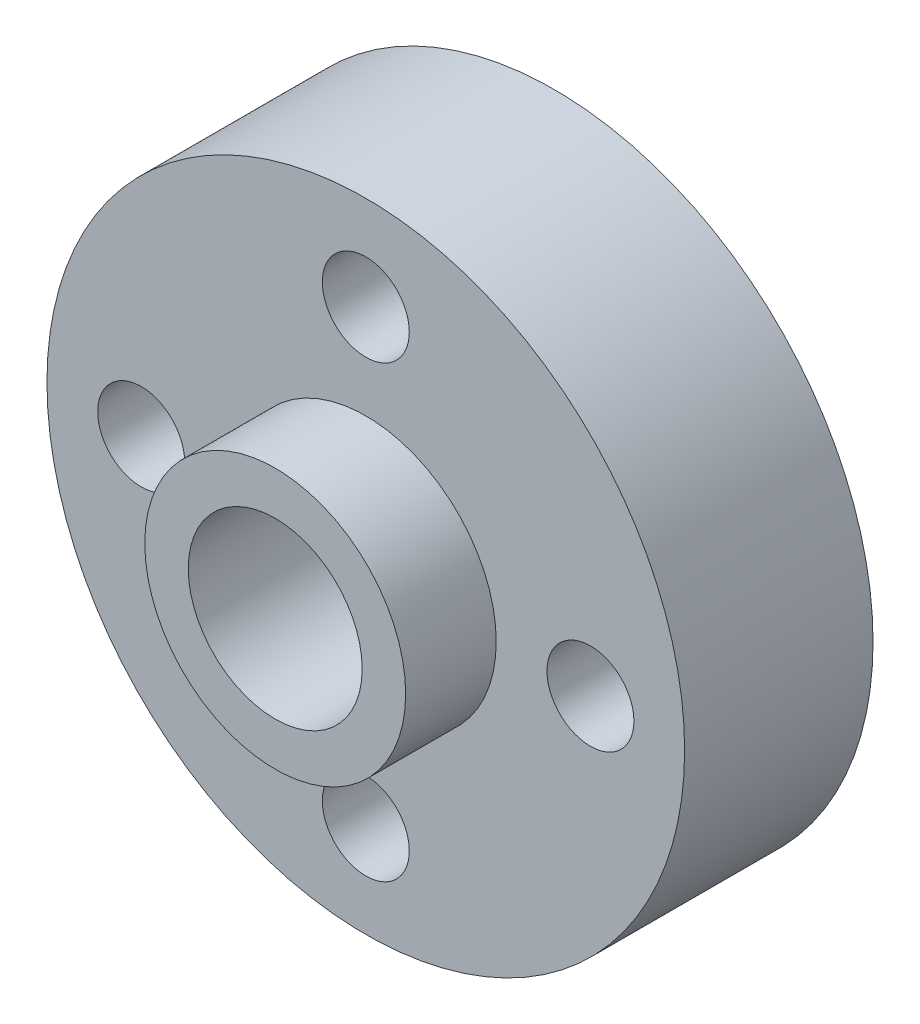
ISO-10303-21;
HEADER;
FILE_DESCRIPTION(('STEP AP214'),'2;1');
FILE_NAME('part.step','',(''),(''),'','','');
FILE_SCHEMA(('AUTOMOTIVE_DESIGN { 1 0 10303 214 1 1 1 1 }'));
ENDSEC;
DATA;
#1=APPLICATION_CONTEXT('core data for automotive mechanical design processes');
#2=APPLICATION_PROTOCOL_DEFINITION('international standard','automotive_design',2000,#1);
#3=PRODUCT_CONTEXT('',#1,'mechanical');
#4=PRODUCT('Part','Part','',(#3));
#5=PRODUCT_RELATED_PRODUCT_CATEGORY('part','',(#4));
#6=PRODUCT_DEFINITION_FORMATION('','',#4);
#7=PRODUCT_DEFINITION_CONTEXT('part definition',#1,'design');
#8=PRODUCT_DEFINITION('design','',#6,#7);
#9=PRODUCT_DEFINITION_SHAPE('','',#8);
#10=(LENGTH_UNIT() NAMED_UNIT(*) SI_UNIT(.MILLI.,.METRE.));
#11=(NAMED_UNIT(*) PLANE_ANGLE_UNIT() SI_UNIT($,.RADIAN.));
#12=(NAMED_UNIT(*) SI_UNIT($,.STERADIAN.) SOLID_ANGLE_UNIT());
#13=UNCERTAINTY_MEASURE_WITH_UNIT(LENGTH_MEASURE(1.E-05),#10,'distance_accuracy_value','');
#14=(GEOMETRIC_REPRESENTATION_CONTEXT(3) GLOBAL_UNCERTAINTY_ASSIGNED_CONTEXT((#13)) GLOBAL_UNIT_ASSIGNED_CONTEXT((#10,
#11,#12)) REPRESENTATION_CONTEXT('',''));
#15=CARTESIAN_POINT('',(0.,0.,0.));
#16=DIRECTION('',(0.,0.,1.));
#17=DIRECTION('',(1.,0.,0.));
#18=AXIS2_PLACEMENT_3D('',#15,#16,#17);
#19=CARTESIAN_POINT('',(0.,0.,0.));
#20=DIRECTION('',(0.,0.,1.));
#21=DIRECTION('',(1.,0.,0.));
#22=AXIS2_PLACEMENT_3D('',#19,#20,#21);
#23=PLANE('',#22);
#24=CARTESIAN_POINT('',(7.75,0.,0.));
#25=DIRECTION('',(0.,0.,1.));
#26=DIRECTION('',(1.,0.,0.));
#27=AXIS2_PLACEMENT_3D('',#24,#25,#26);
#28=CIRCLE('',#27,1.5);
#29=CARTESIAN_POINT('',(9.25,0.,0.));
#30=VERTEX_POINT('',#29);
#31=EDGE_CURVE('E77',#30,#30,#28,.F.);
#32=ORIENTED_EDGE('',*,*,#31,.F.);
#33=EDGE_LOOP('',(#32));
#34=FACE_BOUND('',#33,.T.);
#35=CARTESIAN_POINT('',(-7.75,0.,0.));
#36=DIRECTION('',(0.,0.,1.));
#37=DIRECTION('',(1.,0.,0.));
#38=AXIS2_PLACEMENT_3D('',#35,#36,#37);
#39=CIRCLE('',#38,1.5);
#40=CARTESIAN_POINT('',(-6.25,0.,0.));
#41=VERTEX_POINT('',#40);
#42=EDGE_CURVE('E71',#41,#41,#39,.F.);
#43=ORIENTED_EDGE('',*,*,#42,.F.);
#44=EDGE_LOOP('',(#43));
#45=FACE_BOUND('',#44,.T.);
#46=CARTESIAN_POINT('',(0.,-7.75,0.));
#47=DIRECTION('',(0.,0.,1.));
#48=DIRECTION('',(1.,0.,0.));
#49=AXIS2_PLACEMENT_3D('',#46,#47,#48);
#50=CIRCLE('',#49,1.5);
#51=CARTESIAN_POINT('',(1.5,-7.75,0.));
#52=VERTEX_POINT('',#51);
#53=EDGE_CURVE('E65',#52,#52,#50,.F.);
#54=ORIENTED_EDGE('',*,*,#53,.F.);
#55=EDGE_LOOP('',(#54));
#56=FACE_BOUND('',#55,.T.);
#57=CARTESIAN_POINT('',(0.,7.75,0.));
#58=DIRECTION('',(0.,0.,1.));
#59=DIRECTION('',(1.,0.,0.));
#60=AXIS2_PLACEMENT_3D('',#57,#58,#59);
#61=CIRCLE('',#60,1.5);
#62=CARTESIAN_POINT('',(1.5,7.75,0.));
#63=VERTEX_POINT('',#62);
#64=EDGE_CURVE('E59',#63,#63,#61,.F.);
#65=ORIENTED_EDGE('',*,*,#64,.F.);
#66=EDGE_LOOP('',(#65));
#67=FACE_BOUND('',#66,.T.);
#68=CARTESIAN_POINT('',(0.,0.,0.));
#69=DIRECTION('',(0.,0.,1.));
#70=DIRECTION('',(1.,0.,0.));
#71=AXIS2_PLACEMENT_3D('',#68,#69,#70);
#72=CIRCLE('',#71,11.);
#73=CARTESIAN_POINT('',(11.,0.,0.));
#74=VERTEX_POINT('',#73);
#75=EDGE_CURVE('E38',#74,#74,#72,.T.);
#76=ORIENTED_EDGE('',*,*,#75,.F.);
#77=EDGE_LOOP('',(#76));
#78=FACE_BOUND('',#77,.T.);
#79=CARTESIAN_POINT('',(0.,0.,0.));
#80=DIRECTION('',(0.,0.,1.));
#81=DIRECTION('',(1.,0.,0.));
#82=AXIS2_PLACEMENT_3D('',#79,#80,#81);
#83=CIRCLE('',#82,4.5);
#84=CARTESIAN_POINT('',(4.5,0.,0.));
#85=VERTEX_POINT('',#84);
#86=EDGE_CURVE('E10',#85,#85,#83,.F.);
#87=ORIENTED_EDGE('',*,*,#86,.F.);
#88=EDGE_LOOP('',(#87));
#89=FACE_BOUND('',#88,.T.);
#90=ADVANCED_FACE('F27',(#34,#45,#56,#67,#78,#89),#23,.F.);
#91=CARTESIAN_POINT('',(0.,0.,6.5));
#92=DIRECTION('',(0.,0.,1.));
#93=DIRECTION('',(1.,0.,0.));
#94=AXIS2_PLACEMENT_3D('',#91,#92,#93);
#95=PLANE('',#94);
#96=CARTESIAN_POINT('',(7.75,0.,6.5));
#97=DIRECTION('',(0.,0.,1.));
#98=DIRECTION('',(-1.,0.,0.));
#99=AXIS2_PLACEMENT_3D('',#96,#97,#98);
#100=CIRCLE('',#99,1.5);
#101=CARTESIAN_POINT('',(6.25,0.,6.5));
#102=VERTEX_POINT('',#101);
#103=EDGE_CURVE('E80',#102,#102,#100,.T.);
#104=ORIENTED_EDGE('',*,*,#103,.F.);
#105=EDGE_LOOP('',(#104));
#106=FACE_BOUND('',#105,.T.);
#107=CARTESIAN_POINT('',(-7.75,0.,6.5));
#108=DIRECTION('',(0.,0.,1.));
#109=DIRECTION('',(1.,0.,0.));
#110=AXIS2_PLACEMENT_3D('',#107,#108,#109);
#111=CIRCLE('',#110,1.5);
#112=CARTESIAN_POINT('',(-6.25,0.,6.5));
#113=VERTEX_POINT('',#112);
#114=EDGE_CURVE('E74',#113,#113,#111,.T.);
#115=ORIENTED_EDGE('',*,*,#114,.F.);
#116=EDGE_LOOP('',(#115));
#117=FACE_BOUND('',#116,.T.);
#118=CARTESIAN_POINT('',(0.,-7.75,6.5));
#119=DIRECTION('',(0.,0.,1.));
#120=DIRECTION('',(-1.,0.,0.));
#121=AXIS2_PLACEMENT_3D('',#118,#119,#120);
#122=CIRCLE('',#121,1.5);
#123=CARTESIAN_POINT('',(-1.5,-7.75,6.5));
#124=VERTEX_POINT('',#123);
#125=EDGE_CURVE('E68',#124,#124,#122,.T.);
#126=ORIENTED_EDGE('',*,*,#125,.F.);
#127=EDGE_LOOP('',(#126));
#128=FACE_BOUND('',#127,.T.);
#129=CARTESIAN_POINT('',(0.,7.75,6.5));
#130=DIRECTION('',(0.,0.,1.));
#131=DIRECTION('',(1.,0.,0.));
#132=AXIS2_PLACEMENT_3D('',#129,#130,#131);
#133=CIRCLE('',#132,1.5);
#134=CARTESIAN_POINT('',(1.5,7.75,6.5));
#135=VERTEX_POINT('',#134);
#136=EDGE_CURVE('E62',#135,#135,#133,.T.);
#137=ORIENTED_EDGE('',*,*,#136,.F.);
#138=EDGE_LOOP('',(#137));
#139=FACE_BOUND('',#138,.T.);
#140=CARTESIAN_POINT('',(0.,0.,6.5));
#141=DIRECTION('',(0.,0.,1.));
#142=DIRECTION('',(1.,0.,0.));
#143=AXIS2_PLACEMENT_3D('',#140,#141,#142);
#144=CIRCLE('',#143,11.);
#145=CARTESIAN_POINT('',(11.,0.,6.5));
#146=VERTEX_POINT('',#145);
#147=EDGE_CURVE('E34',#146,#146,#144,.T.);
#148=ORIENTED_EDGE('',*,*,#147,.T.);
#149=EDGE_LOOP('',(#148));
#150=FACE_BOUND('',#149,.T.);
#151=CARTESIAN_POINT('',(0.,0.,6.5));
#152=DIRECTION('',(0.,0.,1.));
#153=DIRECTION('',(1.,0.,0.));
#154=AXIS2_PLACEMENT_3D('',#151,#152,#153);
#155=CIRCLE('',#154,4.5);
#156=CARTESIAN_POINT('',(4.5,0.,6.5));
#157=VERTEX_POINT('',#156);
#158=EDGE_CURVE('E47',#157,#157,#155,.T.);
#159=ORIENTED_EDGE('',*,*,#158,.F.);
#160=EDGE_LOOP('',(#159));
#161=FACE_BOUND('',#160,.T.);
#162=ADVANCED_FACE('F87',(#106,#117,#128,#139,#150,#161),#95,.T.);
#163=CARTESIAN_POINT('',(0.,0.,6.5));
#164=DIRECTION('',(0.,0.,-1.));
#165=DIRECTION('',(-1.,0.,0.));
#166=AXIS2_PLACEMENT_3D('',#163,#164,#165);
#167=CYLINDRICAL_SURFACE('',#166,11.);
#168=ORIENTED_EDGE('',*,*,#147,.F.);
#169=EDGE_LOOP('',(#168));
#170=FACE_BOUND('',#169,.T.);
#171=ORIENTED_EDGE('',*,*,#75,.T.);
#172=EDGE_LOOP('',(#171));
#173=FACE_BOUND('',#172,.T.);
#174=ADVANCED_FACE('F29',(#170,#173),#167,.T.);
#175=CARTESIAN_POINT('',(0.,0.,6.5));
#176=DIRECTION('',(0.,0.,-1.));
#177=DIRECTION('',(-1.,0.,0.));
#178=AXIS2_PLACEMENT_3D('',#175,#176,#177);
#179=CYLINDRICAL_SURFACE('',#178,3.);
#180=CARTESIAN_POINT('',(0.,0.,9.625));
#181=DIRECTION('',(0.,0.,1.));
#182=DIRECTION('',(1.,0.,0.));
#183=AXIS2_PLACEMENT_3D('',#180,#181,#182);
#184=CIRCLE('',#183,3.);
#185=CARTESIAN_POINT('',(3.,0.,9.625));
#186=VERTEX_POINT('',#185);
#187=EDGE_CURVE('E50',#186,#186,#184,.T.);
#188=ORIENTED_EDGE('',*,*,#187,.T.);
#189=EDGE_LOOP('',(#188));
#190=FACE_BOUND('',#189,.T.);
#191=CARTESIAN_POINT('',(0.,0.,-3.125));
#192=DIRECTION('',(0.,0.,-1.));
#193=DIRECTION('',(-1.,0.,0.));
#194=AXIS2_PLACEMENT_3D('',#191,#192,#193);
#195=CIRCLE('',#194,3.);
#196=CARTESIAN_POINT('',(-3.,0.,-3.125));
#197=VERTEX_POINT('',#196);
#198=EDGE_CURVE('E56',#197,#197,#195,.T.);
#199=ORIENTED_EDGE('',*,*,#198,.T.);
#200=EDGE_LOOP('',(#199));
#201=FACE_BOUND('',#200,.T.);
#202=ADVANCED_FACE('F112',(#190,#201),#179,.F.);
#203=CARTESIAN_POINT('',(0.,0.,9.625));
#204=DIRECTION('',(0.,0.,1.));
#205=DIRECTION('',(1.,0.,0.));
#206=AXIS2_PLACEMENT_3D('',#203,#204,#205);
#207=PLANE('',#206);
#208=CARTESIAN_POINT('',(0.,0.,9.625));
#209=DIRECTION('',(0.,0.,1.));
#210=DIRECTION('',(1.,0.,0.));
#211=AXIS2_PLACEMENT_3D('',#208,#209,#210);
#212=CIRCLE('',#211,4.5);
#213=CARTESIAN_POINT('',(4.5,0.,9.625));
#214=VERTEX_POINT('',#213);
#215=EDGE_CURVE('E42',#214,#214,#212,.T.);
#216=ORIENTED_EDGE('',*,*,#215,.T.);
#217=EDGE_LOOP('',(#216));
#218=FACE_BOUND('',#217,.T.);
#219=ORIENTED_EDGE('',*,*,#187,.F.);
#220=EDGE_LOOP('',(#219));
#221=FACE_BOUND('',#220,.T.);
#222=ADVANCED_FACE('F101',(#218,#221),#207,.T.);
#223=CARTESIAN_POINT('',(0.,0.,9.625));
#224=DIRECTION('',(0.,0.,-1.));
#225=DIRECTION('',(-1.,0.,0.));
#226=AXIS2_PLACEMENT_3D('',#223,#224,#225);
#227=CYLINDRICAL_SURFACE('',#226,4.5);
#228=ORIENTED_EDGE('',*,*,#215,.F.);
#229=EDGE_LOOP('',(#228));
#230=FACE_BOUND('',#229,.T.);
#231=ORIENTED_EDGE('',*,*,#158,.T.);
#232=EDGE_LOOP('',(#231));
#233=FACE_BOUND('',#232,.T.);
#234=ADVANCED_FACE('F98',(#230,#233),#227,.T.);
#235=CARTESIAN_POINT('',(0.,0.,-3.125));
#236=DIRECTION('',(0.,0.,-1.));
#237=DIRECTION('',(-1.,0.,0.));
#238=AXIS2_PLACEMENT_3D('',#235,#236,#237);
#239=PLANE('',#238);
#240=CARTESIAN_POINT('',(0.,0.,-3.125));
#241=DIRECTION('',(0.,0.,-1.));
#242=DIRECTION('',(-1.,0.,0.));
#243=AXIS2_PLACEMENT_3D('',#240,#241,#242);
#244=CIRCLE('',#243,4.5);
#245=CARTESIAN_POINT('',(-4.5,0.,-3.125));
#246=VERTEX_POINT('',#245);
#247=EDGE_CURVE('E53',#246,#246,#244,.T.);
#248=ORIENTED_EDGE('',*,*,#247,.T.);
#249=EDGE_LOOP('',(#248));
#250=FACE_BOUND('',#249,.T.);
#251=ORIENTED_EDGE('',*,*,#198,.F.);
#252=EDGE_LOOP('',(#251));
#253=FACE_BOUND('',#252,.T.);
#254=ADVANCED_FACE('F100',(#250,#253),#239,.T.);
#255=CARTESIAN_POINT('',(0.,0.,-3.125));
#256=DIRECTION('',(0.,0.,1.));
#257=DIRECTION('',(1.,0.,0.));
#258=AXIS2_PLACEMENT_3D('',#255,#256,#257);
#259=CYLINDRICAL_SURFACE('',#258,4.5);
#260=ORIENTED_EDGE('',*,*,#247,.F.);
#261=EDGE_LOOP('',(#260));
#262=FACE_BOUND('',#261,.T.);
#263=ORIENTED_EDGE('',*,*,#86,.T.);
#264=EDGE_LOOP('',(#263));
#265=FACE_BOUND('',#264,.T.);
#266=ADVANCED_FACE('F109',(#262,#265),#259,.T.);
#267=CARTESIAN_POINT('',(0.,7.75,-3.126));
#268=DIRECTION('',(0.,0.,1.));
#269=DIRECTION('',(1.,0.,0.));
#270=AXIS2_PLACEMENT_3D('',#267,#268,#269);
#271=CYLINDRICAL_SURFACE('',#270,1.5);
#272=ORIENTED_EDGE('',*,*,#136,.T.);
#273=EDGE_LOOP('',(#272));
#274=FACE_BOUND('',#273,.T.);
#275=ORIENTED_EDGE('',*,*,#64,.T.);
#276=EDGE_LOOP('',(#275));
#277=FACE_BOUND('',#276,.T.);
#278=ADVANCED_FACE('F166',(#274,#277),#271,.F.);
#279=CARTESIAN_POINT('',(0.,-7.75,-3.126));
#280=DIRECTION('',(0.,0.,1.));
#281=DIRECTION('',(1.,0.,0.));
#282=AXIS2_PLACEMENT_3D('',#279,#280,#281);
#283=CYLINDRICAL_SURFACE('',#282,1.5);
#284=ORIENTED_EDGE('',*,*,#125,.T.);
#285=EDGE_LOOP('',(#284));
#286=FACE_BOUND('',#285,.T.);
#287=ORIENTED_EDGE('',*,*,#53,.T.);
#288=EDGE_LOOP('',(#287));
#289=FACE_BOUND('',#288,.T.);
#290=ADVANCED_FACE('F174',(#286,#289),#283,.F.);
#291=CARTESIAN_POINT('',(-7.75,0.,-3.126));
#292=DIRECTION('',(0.,0.,1.));
#293=DIRECTION('',(1.,0.,0.));
#294=AXIS2_PLACEMENT_3D('',#291,#292,#293);
#295=CYLINDRICAL_SURFACE('',#294,1.5);
#296=ORIENTED_EDGE('',*,*,#114,.T.);
#297=EDGE_LOOP('',(#296));
#298=FACE_BOUND('',#297,.T.);
#299=ORIENTED_EDGE('',*,*,#42,.T.);
#300=EDGE_LOOP('',(#299));
#301=FACE_BOUND('',#300,.T.);
#302=ADVANCED_FACE('F182',(#298,#301),#295,.F.);
#303=CARTESIAN_POINT('',(7.75,0.,-3.126));
#304=DIRECTION('',(0.,0.,1.));
#305=DIRECTION('',(1.,0.,0.));
#306=AXIS2_PLACEMENT_3D('',#303,#304,#305);
#307=CYLINDRICAL_SURFACE('',#306,1.5);
#308=ORIENTED_EDGE('',*,*,#103,.T.);
#309=EDGE_LOOP('',(#308));
#310=FACE_BOUND('',#309,.T.);
#311=ORIENTED_EDGE('',*,*,#31,.T.);
#312=EDGE_LOOP('',(#311));
#313=FACE_BOUND('',#312,.T.);
#314=ADVANCED_FACE('F84',(#310,#313),#307,.F.);
#315=CLOSED_SHELL('',(#90,#162,#174,#202,#222,#234,#254,#266,#278,#290,#302,#314));
#316=MANIFOLD_SOLID_BREP('B2',#315);
#317=ADVANCED_BREP_SHAPE_REPRESENTATION('',(#18,#316),#14);
#318=SHAPE_DEFINITION_REPRESENTATION(#9,#317);
ENDSEC;
END-ISO-10303-21;
